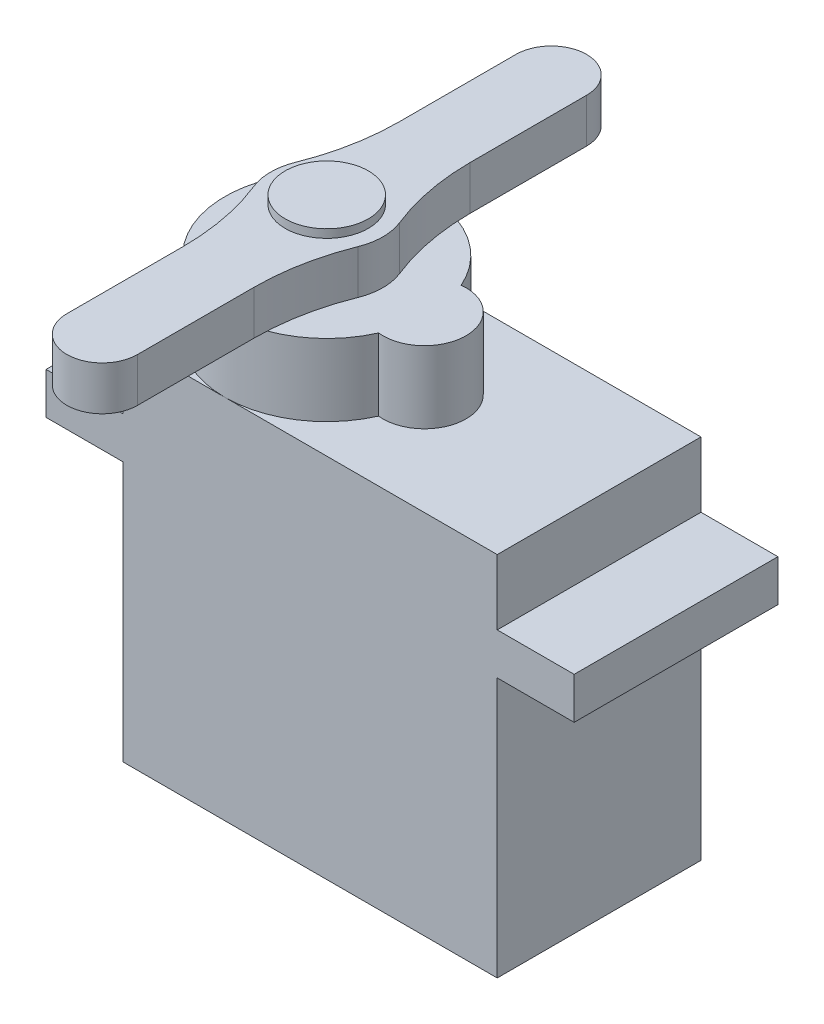
ISO-10303-21;
HEADER;
FILE_DESCRIPTION(('STEP AP214'),'2;1');
FILE_NAME('part.step','',(''),(''),'','','');
FILE_SCHEMA(('AUTOMOTIVE_DESIGN { 1 0 10303 214 1 1 1 1 }'));
ENDSEC;
DATA;
#1=APPLICATION_CONTEXT('core data for automotive mechanical design processes');
#2=APPLICATION_PROTOCOL_DEFINITION('international standard','automotive_design',2000,#1);
#3=PRODUCT_CONTEXT('',#1,'mechanical');
#4=PRODUCT('Part','Part','',(#3));
#5=PRODUCT_RELATED_PRODUCT_CATEGORY('part','',(#4));
#6=PRODUCT_DEFINITION_FORMATION('','',#4);
#7=PRODUCT_DEFINITION_CONTEXT('part definition',#1,'design');
#8=PRODUCT_DEFINITION('design','',#6,#7);
#9=PRODUCT_DEFINITION_SHAPE('','',#8);
#10=(LENGTH_UNIT() NAMED_UNIT(*) SI_UNIT(.MILLI.,.METRE.));
#11=(NAMED_UNIT(*) PLANE_ANGLE_UNIT() SI_UNIT($,.RADIAN.));
#12=(NAMED_UNIT(*) SI_UNIT($,.STERADIAN.) SOLID_ANGLE_UNIT());
#13=UNCERTAINTY_MEASURE_WITH_UNIT(LENGTH_MEASURE(1.E-05),#10,'distance_accuracy_value','');
#14=(GEOMETRIC_REPRESENTATION_CONTEXT(3) GLOBAL_UNCERTAINTY_ASSIGNED_CONTEXT((#13)) GLOBAL_UNIT_ASSIGNED_CONTEXT((#10,
#11,#12)) REPRESENTATION_CONTEXT('',''));
#15=CARTESIAN_POINT('',(0.,0.,0.));
#16=DIRECTION('',(0.,0.,1.));
#17=DIRECTION('',(1.,0.,0.));
#18=AXIS2_PLACEMENT_3D('',#15,#16,#17);
#19=CARTESIAN_POINT('',(-11.43,5.588,-1.905));
#20=DIRECTION('',(1.,0.,0.));
#21=DIRECTION('',(0.,0.,-1.));
#22=AXIS2_PLACEMENT_3D('',#19,#20,#21);
#23=PLANE('',#22);
#24=DIRECTION('',(0.,0.,1.));
#25=VECTOR('',#24,1.);
#26=CARTESIAN_POINT('',(-11.43,4.318,-1.905));
#27=LINE('',#26,#25);
#28=CARTESIAN_POINT('',(-11.43,4.318,-1.905));
#29=VERTEX_POINT('',#28);
#30=CARTESIAN_POINT('',(-11.43,4.318,1.905));
#31=VERTEX_POINT('',#30);
#32=EDGE_CURVE('E111',#29,#31,#27,.T.);
#33=ORIENTED_EDGE('',*,*,#32,.F.);
#34=DIRECTION('',(0.,-1.,0.));
#35=VECTOR('',#34,1.);
#36=CARTESIAN_POINT('',(-11.43,5.588,-1.905));
#37=LINE('',#36,#35);
#38=CARTESIAN_POINT('',(-11.43,5.588,-1.905));
#39=VERTEX_POINT('',#38);
#40=EDGE_CURVE('E12',#39,#29,#37,.T.);
#41=ORIENTED_EDGE('',*,*,#40,.F.);
#42=DIRECTION('',(0.,0.,1.));
#43=VECTOR('',#42,1.);
#44=CARTESIAN_POINT('',(-11.43,5.588,-1.905));
#45=LINE('',#44,#43);
#46=CARTESIAN_POINT('',(-11.43,5.588,1.905));
#47=VERTEX_POINT('',#46);
#48=EDGE_CURVE('E105',#39,#47,#45,.T.);
#49=ORIENTED_EDGE('',*,*,#48,.T.);
#50=DIRECTION('',(0.,-1.,0.));
#51=VECTOR('',#50,1.);
#52=CARTESIAN_POINT('',(-11.43,5.588,1.905));
#53=LINE('',#52,#51);
#54=EDGE_CURVE('E50',#47,#31,#53,.T.);
#55=ORIENTED_EDGE('',*,*,#54,.T.);
#56=EDGE_LOOP('',(#33,#41,#49,#55));
#57=FACE_BOUND('',#56,.T.);
#58=ADVANCED_FACE('F47',(#57),#23,.T.);
#59=CARTESIAN_POINT('',(-11.43,5.588,-1.905));
#60=DIRECTION('',(0.,0.,-1.));
#61=DIRECTION('',(-1.,0.,0.));
#62=AXIS2_PLACEMENT_3D('',#59,#60,#61);
#63=PLANE('',#62);
#64=DIRECTION('',(1.,0.,0.));
#65=VECTOR('',#64,1.);
#66=CARTESIAN_POINT('',(-11.43,4.318,-1.905));
#67=LINE('',#66,#65);
#68=CARTESIAN_POINT('',(-13.208,4.318,-1.905));
#69=VERTEX_POINT('',#68);
#70=EDGE_CURVE('E107',#69,#29,#67,.T.);
#71=ORIENTED_EDGE('',*,*,#70,.F.);
#72=DIRECTION('',(0.,-1.,0.));
#73=VECTOR('',#72,1.);
#74=CARTESIAN_POINT('',(-13.208,5.588,-1.905));
#75=LINE('',#74,#73);
#76=CARTESIAN_POINT('',(-13.208,5.588,-1.905));
#77=VERTEX_POINT('',#76);
#78=EDGE_CURVE('E56',#77,#69,#75,.T.);
#79=ORIENTED_EDGE('',*,*,#78,.F.);
#80=DIRECTION('',(1.,0.,0.));
#81=VECTOR('',#80,1.);
#82=CARTESIAN_POINT('',(-11.43,5.588,-1.905));
#83=LINE('',#82,#81);
#84=EDGE_CURVE('E102',#77,#39,#83,.T.);
#85=ORIENTED_EDGE('',*,*,#84,.T.);
#86=ORIENTED_EDGE('',*,*,#40,.T.);
#87=EDGE_LOOP('',(#71,#79,#85,#86));
#88=FACE_BOUND('',#87,.T.);
#89=ADVANCED_FACE('F121',(#88),#63,.T.);
#90=CARTESIAN_POINT('',(-13.208,5.588,-1.905));
#91=DIRECTION('',(-1.,0.,0.));
#92=DIRECTION('',(0.,0.,1.));
#93=AXIS2_PLACEMENT_3D('',#90,#91,#92);
#94=PLANE('',#93);
#95=DIRECTION('',(0.,0.,-1.));
#96=VECTOR('',#95,1.);
#97=CARTESIAN_POINT('',(-13.208,4.318,-1.905));
#98=LINE('',#97,#96);
#99=CARTESIAN_POINT('',(-13.208,4.318,1.905));
#100=VERTEX_POINT('',#99);
#101=EDGE_CURVE('E97',#100,#69,#98,.T.);
#102=ORIENTED_EDGE('',*,*,#101,.F.);
#103=DIRECTION('',(0.,-1.,0.));
#104=VECTOR('',#103,1.);
#105=CARTESIAN_POINT('',(-13.208,5.588,1.905));
#106=LINE('',#105,#104);
#107=CARTESIAN_POINT('',(-13.208,5.588,1.905));
#108=VERTEX_POINT('',#107);
#109=EDGE_CURVE('E92',#108,#100,#106,.T.);
#110=ORIENTED_EDGE('',*,*,#109,.F.);
#111=DIRECTION('',(0.,0.,-1.));
#112=VECTOR('',#111,1.);
#113=CARTESIAN_POINT('',(-13.208,5.588,-1.905));
#114=LINE('',#113,#112);
#115=EDGE_CURVE('E95',#108,#77,#114,.T.);
#116=ORIENTED_EDGE('',*,*,#115,.T.);
#117=ORIENTED_EDGE('',*,*,#78,.T.);
#118=EDGE_LOOP('',(#102,#110,#116,#117));
#119=FACE_BOUND('',#118,.T.);
#120=ADVANCED_FACE('F94',(#119),#94,.T.);
#121=CARTESIAN_POINT('',(-11.43,5.588,1.905));
#122=DIRECTION('',(0.,0.,1.));
#123=DIRECTION('',(1.,0.,0.));
#124=AXIS2_PLACEMENT_3D('',#121,#122,#123);
#125=PLANE('',#124);
#126=DIRECTION('',(-1.,0.,0.));
#127=VECTOR('',#126,1.);
#128=CARTESIAN_POINT('',(-11.43,4.318,1.905));
#129=LINE('',#128,#127);
#130=EDGE_CURVE('E114',#31,#100,#129,.T.);
#131=ORIENTED_EDGE('',*,*,#130,.F.);
#132=ORIENTED_EDGE('',*,*,#54,.F.);
#133=DIRECTION('',(-1.,0.,0.));
#134=VECTOR('',#133,1.);
#135=CARTESIAN_POINT('',(-11.43,5.588,1.905));
#136=LINE('',#135,#134);
#137=EDGE_CURVE('E101',#47,#108,#136,.T.);
#138=ORIENTED_EDGE('',*,*,#137,.T.);
#139=ORIENTED_EDGE('',*,*,#109,.T.);
#140=EDGE_LOOP('',(#131,#132,#138,#139));
#141=FACE_BOUND('',#140,.T.);
#142=ADVANCED_FACE('F104',(#141),#125,.T.);
#143=CARTESIAN_POINT('',(0.,5.588,0.));
#144=DIRECTION('',(0.,-1.,0.));
#145=DIRECTION('',(0.,0.,-1.));
#146=AXIS2_PLACEMENT_3D('',#143,#144,#145);
#147=PLANE('',#146);
#148=ORIENTED_EDGE('',*,*,#48,.F.);
#149=ORIENTED_EDGE('',*,*,#84,.F.);
#150=ORIENTED_EDGE('',*,*,#115,.F.);
#151=ORIENTED_EDGE('',*,*,#137,.F.);
#152=EDGE_LOOP('',(#148,#149,#150,#151));
#153=FACE_BOUND('',#152,.T.);
#154=ADVANCED_FACE('F100',(#153),#147,.F.);
#155=CARTESIAN_POINT('',(0.,4.318,0.));
#156=DIRECTION('',(0.,-1.,0.));
#157=DIRECTION('',(0.,0.,-1.));
#158=AXIS2_PLACEMENT_3D('',#155,#156,#157);
#159=PLANE('',#158);
#160=ORIENTED_EDGE('',*,*,#32,.T.);
#161=ORIENTED_EDGE('',*,*,#130,.T.);
#162=ORIENTED_EDGE('',*,*,#101,.T.);
#163=ORIENTED_EDGE('',*,*,#70,.T.);
#164=EDGE_LOOP('',(#160,#161,#162,#163));
#165=FACE_BOUND('',#164,.T.);
#166=ADVANCED_FACE('F120',(#165),#159,.T.);
#167=CLOSED_SHELL('',(#58,#89,#120,#142,#154,#166));
#168=MANIFOLD_SOLID_BREP('B2',#167);
#169=CARTESIAN_POINT('',(-21.7424,62.4822207368893,-6.604));
#170=DIRECTION('',(0.,-1.,0.));
#171=DIRECTION('',(0.,0.,-1.));
#172=AXIS2_PLACEMENT_3D('',#169,#170,#171);
#173=CYLINDRICAL_SURFACE('',#172,14.3764);
#174=CARTESIAN_POINT('',(-21.7424,29.492,-6.604));
#175=DIRECTION('',(0.,1.,0.));
#176=DIRECTION('',(0.,0.,1.));
#177=AXIS2_PLACEMENT_3D('',#174,#175,#176);
#178=CIRCLE('',#177,14.3764);
#179=CARTESIAN_POINT('',(-7.366,29.492,-6.604));
#180=VERTEX_POINT('',#179);
#181=CARTESIAN_POINT('',(-8.39142082738945,29.492,-1.27181169757489));
#182=VERTEX_POINT('',#181);
#183=EDGE_CURVE('E315',#180,#182,#178,.F.);
#184=ORIENTED_EDGE('',*,*,#183,.F.);
#185=DIRECTION('',(0.,-1.,0.));
#186=VECTOR('',#185,1.);
#187=CARTESIAN_POINT('',(-7.366,62.4822207368893,-6.604));
#188=LINE('',#187,#186);
#189=CARTESIAN_POINT('',(-7.366,26.8,-6.604));
#190=VERTEX_POINT('',#189);
#191=EDGE_CURVE('E184',#180,#190,#188,.T.);
#192=ORIENTED_EDGE('',*,*,#191,.T.);
#193=CARTESIAN_POINT('',(-21.7424,26.8,-6.604));
#194=DIRECTION('',(0.,-1.,0.));
#195=DIRECTION('',(0.,0.,-1.));
#196=AXIS2_PLACEMENT_3D('',#193,#194,#195);
#197=CIRCLE('',#196,14.3764);
#198=CARTESIAN_POINT('',(-8.39142082738945,26.8,-1.27181169757489));
#199=VERTEX_POINT('',#198);
#200=EDGE_CURVE('E323',#190,#199,#197,.T.);
#201=ORIENTED_EDGE('',*,*,#200,.T.);
#202=DIRECTION('',(0.,-1.,0.));
#203=VECTOR('',#202,1.);
#204=CARTESIAN_POINT('',(-8.39142082738945,62.4822207368893,-1.27181169757489));
#205=LINE('',#204,#203);
#206=EDGE_CURVE('E251',#182,#199,#205,.T.);
#207=ORIENTED_EDGE('',*,*,#206,.F.);
#208=EDGE_LOOP('',(#184,#192,#201,#207));
#209=FACE_BOUND('',#208,.T.);
#210=ADVANCED_FACE('F180',(#209),#173,.F.);
#211=CARTESIAN_POINT('',(-5.207,62.4822207368893,0.));
#212=DIRECTION('',(0.,-1.,0.));
#213=DIRECTION('',(0.,0.,-1.));
#214=AXIS2_PLACEMENT_3D('',#211,#212,#213);
#215=CYLINDRICAL_SURFACE('',#214,3.429);
#216=CARTESIAN_POINT('',(-5.207,29.492,0.));
#217=DIRECTION('',(0.,1.,0.));
#218=DIRECTION('',(0.,0.,1.));
#219=AXIS2_PLACEMENT_3D('',#216,#217,#218);
#220=CIRCLE('',#219,3.429);
#221=CARTESIAN_POINT('',(-8.39142082738944,29.492,1.27181169757489));
#222=VERTEX_POINT('',#221);
#223=EDGE_CURVE('E258',#182,#222,#220,.T.);
#224=ORIENTED_EDGE('',*,*,#223,.F.);
#225=ORIENTED_EDGE('',*,*,#206,.T.);
#226=CARTESIAN_POINT('',(-5.207,26.8,0.));
#227=DIRECTION('',(0.,1.,0.));
#228=DIRECTION('',(0.,0.,1.));
#229=AXIS2_PLACEMENT_3D('',#226,#227,#228);
#230=CIRCLE('',#229,3.429);
#231=CARTESIAN_POINT('',(-8.39142082738944,26.8,1.27181169757489));
#232=VERTEX_POINT('',#231);
#233=EDGE_CURVE('E322',#199,#232,#230,.T.);
#234=ORIENTED_EDGE('',*,*,#233,.T.);
#235=DIRECTION('',(0.,-1.,0.));
#236=VECTOR('',#235,1.);
#237=CARTESIAN_POINT('',(-8.39142082738944,62.4822207368893,1.27181169757489));
#238=LINE('',#237,#236);
#239=EDGE_CURVE('E324',#222,#232,#238,.T.);
#240=ORIENTED_EDGE('',*,*,#239,.F.);
#241=EDGE_LOOP('',(#224,#225,#234,#240));
#242=FACE_BOUND('',#241,.T.);
#243=ADVANCED_FACE('F373',(#242),#215,.T.);
#244=CARTESIAN_POINT('',(-21.7424,62.4822207368893,6.604));
#245=DIRECTION('',(0.,-1.,0.));
#246=DIRECTION('',(0.,0.,-1.));
#247=AXIS2_PLACEMENT_3D('',#244,#245,#246);
#248=CYLINDRICAL_SURFACE('',#247,14.3764);
#249=CARTESIAN_POINT('',(-21.7424,29.492,6.604));
#250=DIRECTION('',(0.,1.,0.));
#251=DIRECTION('',(0.,0.,1.));
#252=AXIS2_PLACEMENT_3D('',#249,#250,#251);
#253=CIRCLE('',#252,14.3764);
#254=CARTESIAN_POINT('',(-7.366,29.492,6.604));
#255=VERTEX_POINT('',#254);
#256=EDGE_CURVE('E311',#222,#255,#253,.F.);
#257=ORIENTED_EDGE('',*,*,#256,.F.);
#258=ORIENTED_EDGE('',*,*,#239,.T.);
#259=CARTESIAN_POINT('',(-21.7424,26.8,6.604));
#260=DIRECTION('',(0.,-1.,0.));
#261=DIRECTION('',(0.,0.,-1.));
#262=AXIS2_PLACEMENT_3D('',#259,#260,#261);
#263=CIRCLE('',#262,14.3764);
#264=CARTESIAN_POINT('',(-7.366,26.8,6.604));
#265=VERTEX_POINT('',#264);
#266=EDGE_CURVE('E326',#232,#265,#263,.T.);
#267=ORIENTED_EDGE('',*,*,#266,.T.);
#268=DIRECTION('',(0.,-1.,0.));
#269=VECTOR('',#268,1.);
#270=CARTESIAN_POINT('',(-7.366,62.4822207368893,6.604));
#271=LINE('',#270,#269);
#272=EDGE_CURVE('E327',#255,#265,#271,.T.);
#273=ORIENTED_EDGE('',*,*,#272,.F.);
#274=EDGE_LOOP('',(#257,#258,#267,#273));
#275=FACE_BOUND('',#274,.T.);
#276=ADVANCED_FACE('F376',(#275),#248,.F.);
#277=CARTESIAN_POINT('',(-7.366,62.4822207368893,6.604));
#278=DIRECTION('',(1.,0.,0.));
#279=DIRECTION('',(0.,0.,-1.));
#280=AXIS2_PLACEMENT_3D('',#277,#278,#279);
#281=PLANE('',#280);
#282=DIRECTION('',(0.,0.,1.));
#283=VECTOR('',#282,1.);
#284=CARTESIAN_POINT('',(-7.366,29.492,6.604));
#285=LINE('',#284,#283);
#286=CARTESIAN_POINT('',(-7.366,29.492,13.716));
#287=VERTEX_POINT('',#286);
#288=EDGE_CURVE('E308',#255,#287,#285,.T.);
#289=ORIENTED_EDGE('',*,*,#288,.F.);
#290=ORIENTED_EDGE('',*,*,#272,.T.);
#291=DIRECTION('',(0.,0.,1.));
#292=VECTOR('',#291,1.);
#293=CARTESIAN_POINT('',(-7.366,26.8,6.604));
#294=LINE('',#293,#292);
#295=CARTESIAN_POINT('',(-7.366,26.8,13.716));
#296=VERTEX_POINT('',#295);
#297=EDGE_CURVE('E329',#265,#296,#294,.T.);
#298=ORIENTED_EDGE('',*,*,#297,.T.);
#299=DIRECTION('',(0.,-1.,0.));
#300=VECTOR('',#299,1.);
#301=CARTESIAN_POINT('',(-7.366,62.4822207368893,13.716));
#302=LINE('',#301,#300);
#303=EDGE_CURVE('E330',#287,#296,#302,.T.);
#304=ORIENTED_EDGE('',*,*,#303,.F.);
#305=EDGE_LOOP('',(#289,#290,#298,#304));
#306=FACE_BOUND('',#305,.T.);
#307=ADVANCED_FACE('F378',(#306),#281,.F.);
#308=CARTESIAN_POINT('',(-5.207,62.4822207368893,13.716));
#309=DIRECTION('',(0.,-1.,0.));
#310=DIRECTION('',(0.,0.,-1.));
#311=AXIS2_PLACEMENT_3D('',#308,#309,#310);
#312=CYLINDRICAL_SURFACE('',#311,2.159);
#313=CARTESIAN_POINT('',(-5.207,29.492,13.716));
#314=DIRECTION('',(0.,1.,0.));
#315=DIRECTION('',(0.,0.,1.));
#316=AXIS2_PLACEMENT_3D('',#313,#314,#315);
#317=CIRCLE('',#316,2.159);
#318=CARTESIAN_POINT('',(-3.048,29.492,13.716));
#319=VERTEX_POINT('',#318);
#320=EDGE_CURVE('E305',#287,#319,#317,.T.);
#321=ORIENTED_EDGE('',*,*,#320,.F.);
#322=ORIENTED_EDGE('',*,*,#303,.T.);
#323=CARTESIAN_POINT('',(-5.207,26.8,13.716));
#324=DIRECTION('',(0.,1.,0.));
#325=DIRECTION('',(0.,0.,1.));
#326=AXIS2_PLACEMENT_3D('',#323,#324,#325);
#327=CIRCLE('',#326,2.159);
#328=CARTESIAN_POINT('',(-3.048,26.8,13.716));
#329=VERTEX_POINT('',#328);
#330=EDGE_CURVE('E332',#296,#329,#327,.T.);
#331=ORIENTED_EDGE('',*,*,#330,.T.);
#332=DIRECTION('',(0.,-1.,0.));
#333=VECTOR('',#332,1.);
#334=CARTESIAN_POINT('',(-3.048,62.4822207368893,13.716));
#335=LINE('',#334,#333);
#336=EDGE_CURVE('E333',#319,#329,#335,.T.);
#337=ORIENTED_EDGE('',*,*,#336,.F.);
#338=EDGE_LOOP('',(#321,#322,#331,#337));
#339=FACE_BOUND('',#338,.T.);
#340=ADVANCED_FACE('F382',(#339),#312,.T.);
#341=CARTESIAN_POINT('',(-3.048,62.4822207368893,13.716));
#342=DIRECTION('',(-1.,0.,0.));
#343=DIRECTION('',(0.,0.,1.));
#344=AXIS2_PLACEMENT_3D('',#341,#342,#343);
#345=PLANE('',#344);
#346=DIRECTION('',(0.,0.,-1.));
#347=VECTOR('',#346,1.);
#348=CARTESIAN_POINT('',(-3.048,29.492,13.716));
#349=LINE('',#348,#347);
#350=CARTESIAN_POINT('',(-3.048,29.492,6.604));
#351=VERTEX_POINT('',#350);
#352=EDGE_CURVE('E302',#319,#351,#349,.T.);
#353=ORIENTED_EDGE('',*,*,#352,.F.);
#354=ORIENTED_EDGE('',*,*,#336,.T.);
#355=DIRECTION('',(0.,0.,-1.));
#356=VECTOR('',#355,1.);
#357=CARTESIAN_POINT('',(-3.048,26.8,13.716));
#358=LINE('',#357,#356);
#359=CARTESIAN_POINT('',(-3.048,26.8,6.604));
#360=VERTEX_POINT('',#359);
#361=EDGE_CURVE('E335',#329,#360,#358,.T.);
#362=ORIENTED_EDGE('',*,*,#361,.T.);
#363=DIRECTION('',(0.,-1.,0.));
#364=VECTOR('',#363,1.);
#365=CARTESIAN_POINT('',(-3.048,62.4822207368893,6.604));
#366=LINE('',#365,#364);
#367=EDGE_CURVE('E336',#351,#360,#366,.T.);
#368=ORIENTED_EDGE('',*,*,#367,.F.);
#369=EDGE_LOOP('',(#353,#354,#362,#368));
#370=FACE_BOUND('',#369,.T.);
#371=ADVANCED_FACE('F387',(#370),#345,.F.);
#372=CARTESIAN_POINT('',(11.3284,62.4822207368893,6.604));
#373=DIRECTION('',(0.,-1.,0.));
#374=DIRECTION('',(0.,0.,-1.));
#375=AXIS2_PLACEMENT_3D('',#372,#373,#374);
#376=CYLINDRICAL_SURFACE('',#375,14.3764);
#377=CARTESIAN_POINT('',(11.3284,29.492,6.604));
#378=DIRECTION('',(0.,1.,0.));
#379=DIRECTION('',(0.,0.,1.));
#380=AXIS2_PLACEMENT_3D('',#377,#378,#379);
#381=CIRCLE('',#380,14.3764);
#382=CARTESIAN_POINT('',(-2.02257917261055,29.492,1.27181169757489));
#383=VERTEX_POINT('',#382);
#384=EDGE_CURVE('E299',#351,#383,#381,.F.);
#385=ORIENTED_EDGE('',*,*,#384,.F.);
#386=ORIENTED_EDGE('',*,*,#367,.T.);
#387=CARTESIAN_POINT('',(11.3284,26.8,6.604));
#388=DIRECTION('',(0.,-1.,0.));
#389=DIRECTION('',(0.,0.,1.));
#390=AXIS2_PLACEMENT_3D('',#387,#388,#389);
#391=CIRCLE('',#390,14.3764);
#392=CARTESIAN_POINT('',(-2.02257917261055,26.8,1.27181169757489));
#393=VERTEX_POINT('',#392);
#394=EDGE_CURVE('E338',#360,#393,#391,.T.);
#395=ORIENTED_EDGE('',*,*,#394,.T.);
#396=DIRECTION('',(0.,-1.,0.));
#397=VECTOR('',#396,1.);
#398=CARTESIAN_POINT('',(-2.02257917261055,62.4822207368893,1.27181169757489));
#399=LINE('',#398,#397);
#400=EDGE_CURVE('E339',#383,#393,#399,.T.);
#401=ORIENTED_EDGE('',*,*,#400,.F.);
#402=EDGE_LOOP('',(#385,#386,#395,#401));
#403=FACE_BOUND('',#402,.T.);
#404=ADVANCED_FACE('F390',(#403),#376,.F.);
#405=CARTESIAN_POINT('',(-5.207,62.4822207368893,0.));
#406=DIRECTION('',(0.,-1.,0.));
#407=DIRECTION('',(0.,0.,-1.));
#408=AXIS2_PLACEMENT_3D('',#405,#406,#407);
#409=CYLINDRICAL_SURFACE('',#408,3.429);
#410=CARTESIAN_POINT('',(-5.207,29.492,0.));
#411=DIRECTION('',(0.,1.,0.));
#412=DIRECTION('',(0.,0.,1.));
#413=AXIS2_PLACEMENT_3D('',#410,#411,#412);
#414=CIRCLE('',#413,3.429);
#415=CARTESIAN_POINT('',(-2.02257917261056,29.492,-1.2718116975749));
#416=VERTEX_POINT('',#415);
#417=EDGE_CURVE('E294',#383,#416,#414,.T.);
#418=ORIENTED_EDGE('',*,*,#417,.F.);
#419=ORIENTED_EDGE('',*,*,#400,.T.);
#420=CARTESIAN_POINT('',(-5.207,26.8,0.));
#421=DIRECTION('',(0.,1.,0.));
#422=DIRECTION('',(0.,0.,1.));
#423=AXIS2_PLACEMENT_3D('',#420,#421,#422);
#424=CIRCLE('',#423,3.429);
#425=CARTESIAN_POINT('',(-2.02257917261056,26.8,-1.2718116975749));
#426=VERTEX_POINT('',#425);
#427=EDGE_CURVE('E341',#393,#426,#424,.T.);
#428=ORIENTED_EDGE('',*,*,#427,.T.);
#429=DIRECTION('',(0.,-1.,0.));
#430=VECTOR('',#429,1.);
#431=CARTESIAN_POINT('',(-2.02257917261056,62.4822207368893,-1.2718116975749));
#432=LINE('',#431,#430);
#433=EDGE_CURVE('E342',#416,#426,#432,.T.);
#434=ORIENTED_EDGE('',*,*,#433,.F.);
#435=EDGE_LOOP('',(#418,#419,#428,#434));
#436=FACE_BOUND('',#435,.T.);
#437=ADVANCED_FACE('F394',(#436),#409,.T.);
#438=CARTESIAN_POINT('',(11.3284,62.4822207368893,-6.604));
#439=DIRECTION('',(0.,-1.,0.));
#440=DIRECTION('',(0.,0.,-1.));
#441=AXIS2_PLACEMENT_3D('',#438,#439,#440);
#442=CYLINDRICAL_SURFACE('',#441,14.3764);
#443=CARTESIAN_POINT('',(11.3284,29.492,-6.604));
#444=DIRECTION('',(0.,1.,0.));
#445=DIRECTION('',(0.,0.,1.));
#446=AXIS2_PLACEMENT_3D('',#443,#444,#445);
#447=CIRCLE('',#446,14.3764);
#448=CARTESIAN_POINT('',(-3.048,29.492,-6.604));
#449=VERTEX_POINT('',#448);
#450=EDGE_CURVE('E292',#416,#449,#447,.F.);
#451=ORIENTED_EDGE('',*,*,#450,.F.);
#452=ORIENTED_EDGE('',*,*,#433,.T.);
#453=CARTESIAN_POINT('',(11.3284,26.8,-6.604));
#454=DIRECTION('',(0.,-1.,0.));
#455=DIRECTION('',(0.,0.,1.));
#456=AXIS2_PLACEMENT_3D('',#453,#454,#455);
#457=CIRCLE('',#456,14.3764);
#458=CARTESIAN_POINT('',(-3.048,26.8,-6.604));
#459=VERTEX_POINT('',#458);
#460=EDGE_CURVE('E344',#426,#459,#457,.T.);
#461=ORIENTED_EDGE('',*,*,#460,.T.);
#462=DIRECTION('',(0.,-1.,0.));
#463=VECTOR('',#462,1.);
#464=CARTESIAN_POINT('',(-3.048,62.4822207368893,-6.604));
#465=LINE('',#464,#463);
#466=EDGE_CURVE('E345',#449,#459,#465,.T.);
#467=ORIENTED_EDGE('',*,*,#466,.F.);
#468=EDGE_LOOP('',(#451,#452,#461,#467));
#469=FACE_BOUND('',#468,.T.);
#470=ADVANCED_FACE('F398',(#469),#442,.F.);
#471=CARTESIAN_POINT('',(-3.048,62.4822207368893,-13.716));
#472=DIRECTION('',(-1.,0.,0.));
#473=DIRECTION('',(0.,0.,1.));
#474=AXIS2_PLACEMENT_3D('',#471,#472,#473);
#475=PLANE('',#474);
#476=DIRECTION('',(0.,0.,-1.));
#477=VECTOR('',#476,1.);
#478=CARTESIAN_POINT('',(-3.048,29.492,-13.716));
#479=LINE('',#478,#477);
#480=CARTESIAN_POINT('',(-3.048,29.492,-13.716));
#481=VERTEX_POINT('',#480);
#482=EDGE_CURVE('E189',#449,#481,#479,.T.);
#483=ORIENTED_EDGE('',*,*,#482,.F.);
#484=ORIENTED_EDGE('',*,*,#466,.T.);
#485=DIRECTION('',(0.,0.,-1.));
#486=VECTOR('',#485,1.);
#487=CARTESIAN_POINT('',(-3.048,26.8,-13.716));
#488=LINE('',#487,#486);
#489=CARTESIAN_POINT('',(-3.048,26.8,-13.716));
#490=VERTEX_POINT('',#489);
#491=EDGE_CURVE('E286',#459,#490,#488,.T.);
#492=ORIENTED_EDGE('',*,*,#491,.T.);
#493=DIRECTION('',(0.,-1.,0.));
#494=VECTOR('',#493,1.);
#495=CARTESIAN_POINT('',(-3.048,62.4822207368893,-13.716));
#496=LINE('',#495,#494);
#497=EDGE_CURVE('E277',#481,#490,#496,.T.);
#498=ORIENTED_EDGE('',*,*,#497,.F.);
#499=EDGE_LOOP('',(#483,#484,#492,#498));
#500=FACE_BOUND('',#499,.T.);
#501=ADVANCED_FACE('F283',(#500),#475,.F.);
#502=CARTESIAN_POINT('',(-5.207,62.4822207368893,-13.716));
#503=DIRECTION('',(0.,-1.,0.));
#504=DIRECTION('',(0.,0.,-1.));
#505=AXIS2_PLACEMENT_3D('',#502,#503,#504);
#506=CYLINDRICAL_SURFACE('',#505,2.159);
#507=CARTESIAN_POINT('',(-5.207,29.492,-13.716));
#508=DIRECTION('',(0.,1.,0.));
#509=DIRECTION('',(0.,0.,1.));
#510=AXIS2_PLACEMENT_3D('',#507,#508,#509);
#511=CIRCLE('',#510,2.159);
#512=CARTESIAN_POINT('',(-7.366,29.492,-13.716));
#513=VERTEX_POINT('',#512);
#514=EDGE_CURVE('E45',#481,#513,#511,.T.);
#515=ORIENTED_EDGE('',*,*,#514,.F.);
#516=ORIENTED_EDGE('',*,*,#497,.T.);
#517=CARTESIAN_POINT('',(-5.207,26.8,-13.716));
#518=DIRECTION('',(0.,1.,0.));
#519=DIRECTION('',(0.,0.,-1.));
#520=AXIS2_PLACEMENT_3D('',#517,#518,#519);
#521=CIRCLE('',#520,2.159);
#522=CARTESIAN_POINT('',(-7.366,26.8,-13.716));
#523=VERTEX_POINT('',#522);
#524=EDGE_CURVE('E288',#490,#523,#521,.T.);
#525=ORIENTED_EDGE('',*,*,#524,.T.);
#526=DIRECTION('',(0.,-1.,0.));
#527=VECTOR('',#526,1.);
#528=CARTESIAN_POINT('',(-7.366,62.4822207368893,-13.716));
#529=LINE('',#528,#527);
#530=EDGE_CURVE('E202',#513,#523,#529,.T.);
#531=ORIENTED_EDGE('',*,*,#530,.F.);
#532=EDGE_LOOP('',(#515,#516,#525,#531));
#533=FACE_BOUND('',#532,.T.);
#534=ADVANCED_FACE('F276',(#533),#506,.T.);
#535=CARTESIAN_POINT('',(-7.366,62.4822207368893,-6.604));
#536=DIRECTION('',(1.,0.,0.));
#537=DIRECTION('',(0.,0.,-1.));
#538=AXIS2_PLACEMENT_3D('',#535,#536,#537);
#539=PLANE('',#538);
#540=DIRECTION('',(0.,0.,1.));
#541=VECTOR('',#540,1.);
#542=CARTESIAN_POINT('',(-7.366,29.492,-6.604));
#543=LINE('',#542,#541);
#544=EDGE_CURVE('E318',#513,#180,#543,.T.);
#545=ORIENTED_EDGE('',*,*,#544,.F.);
#546=ORIENTED_EDGE('',*,*,#530,.T.);
#547=DIRECTION('',(0.,0.,1.));
#548=VECTOR('',#547,1.);
#549=CARTESIAN_POINT('',(-7.366,26.8,-6.604));
#550=LINE('',#549,#548);
#551=EDGE_CURVE('E320',#523,#190,#550,.T.);
#552=ORIENTED_EDGE('',*,*,#551,.T.);
#553=ORIENTED_EDGE('',*,*,#191,.F.);
#554=EDGE_LOOP('',(#545,#546,#552,#553));
#555=FACE_BOUND('',#554,.T.);
#556=ADVANCED_FACE('F368',(#555),#539,.F.);
#557=CARTESIAN_POINT('',(-21.7424,26.8,-6.604));
#558=DIRECTION('',(0.,-1.,0.));
#559=DIRECTION('',(0.,0.,-1.));
#560=AXIS2_PLACEMENT_3D('',#557,#558,#559);
#561=PLANE('',#560);
#562=ORIENTED_EDGE('',*,*,#200,.F.);
#563=ORIENTED_EDGE('',*,*,#551,.F.);
#564=ORIENTED_EDGE('',*,*,#524,.F.);
#565=ORIENTED_EDGE('',*,*,#491,.F.);
#566=ORIENTED_EDGE('',*,*,#460,.F.);
#567=ORIENTED_EDGE('',*,*,#427,.F.);
#568=ORIENTED_EDGE('',*,*,#394,.F.);
#569=ORIENTED_EDGE('',*,*,#361,.F.);
#570=ORIENTED_EDGE('',*,*,#330,.F.);
#571=ORIENTED_EDGE('',*,*,#297,.F.);
#572=ORIENTED_EDGE('',*,*,#266,.F.);
#573=ORIENTED_EDGE('',*,*,#233,.F.);
#574=EDGE_LOOP('',(#562,#563,#564,#565,#566,#567,#568,#569,#570,#571,#572,#573));
#575=FACE_BOUND('',#574,.T.);
#576=ADVANCED_FACE('F370',(#575),#561,.T.);
#577=CARTESIAN_POINT('',(0.,29.492,0.));
#578=DIRECTION('',(0.,1.,0.));
#579=DIRECTION('',(0.,0.,1.));
#580=AXIS2_PLACEMENT_3D('',#577,#578,#579);
#581=PLANE('',#580);
#582=ORIENTED_EDGE('',*,*,#544,.T.);
#583=ORIENTED_EDGE('',*,*,#183,.T.);
#584=ORIENTED_EDGE('',*,*,#223,.T.);
#585=ORIENTED_EDGE('',*,*,#256,.T.);
#586=ORIENTED_EDGE('',*,*,#288,.T.);
#587=ORIENTED_EDGE('',*,*,#320,.T.);
#588=ORIENTED_EDGE('',*,*,#352,.T.);
#589=ORIENTED_EDGE('',*,*,#384,.T.);
#590=ORIENTED_EDGE('',*,*,#417,.T.);
#591=ORIENTED_EDGE('',*,*,#450,.T.);
#592=ORIENTED_EDGE('',*,*,#482,.T.);
#593=ORIENTED_EDGE('',*,*,#514,.T.);
#594=EDGE_LOOP('',(#582,#583,#584,#585,#586,#587,#588,#589,#590,#591,#592,#593));
#595=FACE_BOUND('',#594,.T.);
#596=ADVANCED_FACE('F182',(#595),#581,.T.);
#597=CLOSED_SHELL('',(#210,#243,#276,#307,#340,#371,#404,#437,#470,#501,#534,#556,#576,#596));
#598=MANIFOLD_SOLID_BREP('B6',#597);
#599=CARTESIAN_POINT('',(0.,22.4,0.));
#600=DIRECTION('',(0.,1.,0.));
#601=DIRECTION('',(0.,0.,1.));
#602=AXIS2_PLACEMENT_3D('',#599,#600,#601);
#603=PLANE('',#602);
#604=CARTESIAN_POINT('',(-5.207,22.4,0.));
#605=DIRECTION('',(0.,1.,0.));
#606=DIRECTION('',(0.,0.,1.));
#607=AXIS2_PLACEMENT_3D('',#604,#605,#606);
#608=CIRCLE('',#607,6.223);
#609=CARTESIAN_POINT('',(0.480978723404256,22.4,-2.5244062751666));
#610=VERTEX_POINT('',#609);
#611=CARTESIAN_POINT('',(-5.207,22.4,-6.223));
#612=VERTEX_POINT('',#611);
#613=EDGE_CURVE('E523',#610,#612,#608,.T.);
#614=ORIENTED_EDGE('',*,*,#613,.F.);
#615=CARTESIAN_POINT('',(0.761999999999999,22.4,0.));
#616=DIRECTION('',(0.,1.,0.));
#617=DIRECTION('',(0.,0.,1.));
#618=AXIS2_PLACEMENT_3D('',#615,#616,#617);
#619=CIRCLE('',#618,2.54);
#620=CARTESIAN_POINT('',(0.480978723404255,22.4,2.5244062751666));
#621=VERTEX_POINT('',#620);
#622=EDGE_CURVE('E530',#621,#610,#619,.T.);
#623=ORIENTED_EDGE('',*,*,#622,.F.);
#624=CARTESIAN_POINT('',(-5.207,22.4,6.223));
#625=VERTEX_POINT('',#624);
#626=EDGE_CURVE('E632',#625,#621,#608,.T.);
#627=ORIENTED_EDGE('',*,*,#626,.F.);
#628=DIRECTION('',(1.,0.,0.));
#629=VECTOR('',#628,1.);
#630=CARTESIAN_POINT('',(-11.43,22.4,6.223));
#631=LINE('',#630,#629);
#632=CARTESIAN_POINT('',(11.43,22.4,6.223));
#633=VERTEX_POINT('',#632);
#634=EDGE_CURVE('E699',#625,#633,#631,.T.);
#635=ORIENTED_EDGE('',*,*,#634,.T.);
#636=DIRECTION('',(0.,0.,-1.));
#637=VECTOR('',#636,1.);
#638=CARTESIAN_POINT('',(11.43,22.4,-6.223));
#639=LINE('',#638,#637);
#640=CARTESIAN_POINT('',(11.43,22.4,-6.223));
#641=VERTEX_POINT('',#640);
#642=EDGE_CURVE('E704',#633,#641,#639,.T.);
#643=ORIENTED_EDGE('',*,*,#642,.T.);
#644=DIRECTION('',(-1.,0.,0.));
#645=VECTOR('',#644,1.);
#646=CARTESIAN_POINT('',(-11.43,22.4,-6.223));
#647=LINE('',#646,#645);
#648=EDGE_CURVE('E707',#641,#612,#647,.T.);
#649=ORIENTED_EDGE('',*,*,#648,.T.);
#650=EDGE_LOOP('',(#614,#623,#627,#635,#643,#649));
#651=FACE_BOUND('',#650,.T.);
#652=ADVANCED_FACE('F512',(#651),#603,.T.);
#653=CARTESIAN_POINT('',(-11.43,22.4,0.));
#654=VERTEX_POINT('',#653);
#655=EDGE_CURVE('E178',#612,#654,#608,.T.);
#656=ORIENTED_EDGE('',*,*,#655,.F.);
#657=CARTESIAN_POINT('',(-11.43,22.4,-6.223));
#658=VERTEX_POINT('',#657);
#659=EDGE_CURVE('E706',#612,#658,#647,.T.);
#660=ORIENTED_EDGE('',*,*,#659,.T.);
#661=DIRECTION('',(0.,0.,1.));
#662=VECTOR('',#661,1.);
#663=CARTESIAN_POINT('',(-11.43,22.4,-6.223));
#664=LINE('',#663,#662);
#665=EDGE_CURVE('E697',#658,#654,#664,.T.);
#666=ORIENTED_EDGE('',*,*,#665,.T.);
#667=EDGE_LOOP('',(#656,#660,#666));
#668=FACE_BOUND('',#667,.T.);
#669=ADVANCED_FACE('F794',(#668),#603,.T.);
#670=CARTESIAN_POINT('',(11.43,22.4,-6.223));
#671=DIRECTION('',(-1.,0.,0.));
#672=DIRECTION('',(0.,0.,1.));
#673=AXIS2_PLACEMENT_3D('',#670,#671,#672);
#674=PLANE('',#673);
#675=DIRECTION('',(0.,0.,1.));
#676=VECTOR('',#675,1.);
#677=CARTESIAN_POINT('',(11.43,18.415,-11.5645541745825));
#678=LINE('',#677,#676);
#679=CARTESIAN_POINT('',(11.43,18.415,-6.223));
#680=VERTEX_POINT('',#679);
#681=CARTESIAN_POINT('',(11.43,18.415,6.223));
#682=VERTEX_POINT('',#681);
#683=EDGE_CURVE('E653',#680,#682,#678,.T.);
#684=ORIENTED_EDGE('',*,*,#683,.F.);
#685=DIRECTION('',(0.,-1.,0.));
#686=VECTOR('',#685,1.);
#687=CARTESIAN_POINT('',(11.43,22.4,-6.223));
#688=LINE('',#687,#686);
#689=EDGE_CURVE('E725',#641,#680,#688,.T.);
#690=ORIENTED_EDGE('',*,*,#689,.F.);
#691=ORIENTED_EDGE('',*,*,#642,.F.);
#692=DIRECTION('',(0.,-1.,0.));
#693=VECTOR('',#692,1.);
#694=CARTESIAN_POINT('',(11.43,22.4,6.223));
#695=LINE('',#694,#693);
#696=EDGE_CURVE('E728',#633,#682,#695,.T.);
#697=ORIENTED_EDGE('',*,*,#696,.T.);
#698=EDGE_LOOP('',(#684,#690,#691,#697));
#699=FACE_BOUND('',#698,.T.);
#700=ADVANCED_FACE('F763',(#699),#674,.F.);
#701=CARTESIAN_POINT('',(-11.43,22.4,-6.223));
#702=DIRECTION('',(1.,0.,0.));
#703=DIRECTION('',(0.,0.,-1.));
#704=AXIS2_PLACEMENT_3D('',#701,#702,#703);
#705=PLANE('',#704);
#706=DIRECTION('',(0.,0.,1.));
#707=VECTOR('',#706,1.);
#708=CARTESIAN_POINT('',(-11.43,15.875,-11.5645541745825));
#709=LINE('',#708,#707);
#710=CARTESIAN_POINT('',(-11.43,15.875,-6.223));
#711=VERTEX_POINT('',#710);
#712=CARTESIAN_POINT('',(-11.43,15.875,6.223));
#713=VERTEX_POINT('',#712);
#714=EDGE_CURVE('E691',#711,#713,#709,.T.);
#715=ORIENTED_EDGE('',*,*,#714,.F.);
#716=DIRECTION('',(0.,-1.,0.));
#717=VECTOR('',#716,1.);
#718=CARTESIAN_POINT('',(-11.43,22.4,-6.223));
#719=LINE('',#718,#717);
#720=CARTESIAN_POINT('',(-11.43,0.,-6.223));
#721=VERTEX_POINT('',#720);
#722=EDGE_CURVE('E710',#711,#721,#719,.T.);
#723=ORIENTED_EDGE('',*,*,#722,.T.);
#724=DIRECTION('',(0.,0.,1.));
#725=VECTOR('',#724,1.);
#726=CARTESIAN_POINT('',(-11.43,0.,-6.223));
#727=LINE('',#726,#725);
#728=CARTESIAN_POINT('',(-11.43,0.,6.223));
#729=VERTEX_POINT('',#728);
#730=EDGE_CURVE('E696',#721,#729,#727,.T.);
#731=ORIENTED_EDGE('',*,*,#730,.T.);
#732=DIRECTION('',(0.,-1.,0.));
#733=VECTOR('',#732,1.);
#734=CARTESIAN_POINT('',(-11.43,22.4,6.223));
#735=LINE('',#734,#733);
#736=EDGE_CURVE('E729',#713,#729,#735,.T.);
#737=ORIENTED_EDGE('',*,*,#736,.F.);
#738=EDGE_LOOP('',(#715,#723,#731,#737));
#739=FACE_BOUND('',#738,.T.);
#740=ADVANCED_FACE('F788',(#739),#705,.F.);
#741=CARTESIAN_POINT('',(-11.43,18.415,-6.223));
#742=VERTEX_POINT('',#741);
#743=EDGE_CURVE('E722',#658,#742,#719,.T.);
#744=ORIENTED_EDGE('',*,*,#743,.T.);
#745=DIRECTION('',(0.,0.,1.));
#746=VECTOR('',#745,1.);
#747=CARTESIAN_POINT('',(-11.43,18.415,-11.5645541745825));
#748=LINE('',#747,#746);
#749=CARTESIAN_POINT('',(-11.43,18.415,6.223));
#750=VERTEX_POINT('',#749);
#751=EDGE_CURVE('E689',#742,#750,#748,.T.);
#752=ORIENTED_EDGE('',*,*,#751,.T.);
#753=CARTESIAN_POINT('',(-11.43,22.4,6.223));
#754=VERTEX_POINT('',#753);
#755=EDGE_CURVE('E516',#754,#750,#735,.T.);
#756=ORIENTED_EDGE('',*,*,#755,.F.);
#757=EDGE_CURVE('E700',#654,#754,#664,.T.);
#758=ORIENTED_EDGE('',*,*,#757,.F.);
#759=ORIENTED_EDGE('',*,*,#665,.F.);
#760=EDGE_LOOP('',(#744,#752,#756,#758,#759));
#761=FACE_BOUND('',#760,.T.);
#762=ADVANCED_FACE('F514',(#761),#705,.F.);
#763=CARTESIAN_POINT('',(-11.43,22.4,6.223));
#764=DIRECTION('',(0.,0.,-1.));
#765=DIRECTION('',(-1.,0.,0.));
#766=AXIS2_PLACEMENT_3D('',#763,#764,#765);
#767=PLANE('',#766);
#768=DIRECTION('',(1.,0.,0.));
#769=VECTOR('',#768,1.);
#770=CARTESIAN_POINT('',(-11.43,0.,6.223));
#771=LINE('',#770,#769);
#772=CARTESIAN_POINT('',(11.43,0.,6.223));
#773=VERTEX_POINT('',#772);
#774=EDGE_CURVE('E713',#729,#773,#771,.T.);
#775=ORIENTED_EDGE('',*,*,#774,.T.);
#776=CARTESIAN_POINT('',(11.43,15.875,6.223));
#777=VERTEX_POINT('',#776);
#778=EDGE_CURVE('E727',#777,#773,#695,.T.);
#779=ORIENTED_EDGE('',*,*,#778,.F.);
#780=DIRECTION('',(1.,0.,0.));
#781=VECTOR('',#780,1.);
#782=CARTESIAN_POINT('',(11.43,15.875,6.223));
#783=LINE('',#782,#781);
#784=CARTESIAN_POINT('',(16.129,15.875,6.223));
#785=VERTEX_POINT('',#784);
#786=EDGE_CURVE('E641',#777,#785,#783,.T.);
#787=ORIENTED_EDGE('',*,*,#786,.T.);
#788=DIRECTION('',(0.,1.,0.));
#789=VECTOR('',#788,1.);
#790=CARTESIAN_POINT('',(16.129,18.415,6.223));
#791=LINE('',#790,#789);
#792=CARTESIAN_POINT('',(16.129,18.415,6.223));
#793=VERTEX_POINT('',#792);
#794=EDGE_CURVE('E644',#785,#793,#791,.T.);
#795=ORIENTED_EDGE('',*,*,#794,.T.);
#796=DIRECTION('',(-1.,0.,0.));
#797=VECTOR('',#796,1.);
#798=CARTESIAN_POINT('',(11.43,18.415,6.223));
#799=LINE('',#798,#797);
#800=EDGE_CURVE('E658',#793,#682,#799,.T.);
#801=ORIENTED_EDGE('',*,*,#800,.T.);
#802=ORIENTED_EDGE('',*,*,#696,.F.);
#803=ORIENTED_EDGE('',*,*,#634,.F.);
#804=EDGE_CURVE('E701',#754,#625,#631,.T.);
#805=ORIENTED_EDGE('',*,*,#804,.F.);
#806=ORIENTED_EDGE('',*,*,#755,.T.);
#807=DIRECTION('',(-1.,0.,0.));
#808=VECTOR('',#807,1.);
#809=CARTESIAN_POINT('',(-16.129,18.415,6.223));
#810=LINE('',#809,#808);
#811=CARTESIAN_POINT('',(-16.129,18.415,6.223));
#812=VERTEX_POINT('',#811);
#813=EDGE_CURVE('E684',#750,#812,#810,.T.);
#814=ORIENTED_EDGE('',*,*,#813,.T.);
#815=DIRECTION('',(0.,-1.,0.));
#816=VECTOR('',#815,1.);
#817=CARTESIAN_POINT('',(-16.129,18.415,6.223));
#818=LINE('',#817,#816);
#819=CARTESIAN_POINT('',(-16.129,15.875,6.223));
#820=VERTEX_POINT('',#819);
#821=EDGE_CURVE('E671',#812,#820,#818,.T.);
#822=ORIENTED_EDGE('',*,*,#821,.T.);
#823=DIRECTION('',(1.,0.,0.));
#824=VECTOR('',#823,1.);
#825=CARTESIAN_POINT('',(-16.129,15.875,6.223));
#826=LINE('',#825,#824);
#827=EDGE_CURVE('E681',#820,#713,#826,.T.);
#828=ORIENTED_EDGE('',*,*,#827,.T.);
#829=ORIENTED_EDGE('',*,*,#736,.T.);
#830=EDGE_LOOP('',(#775,#779,#787,#795,#801,#802,#803,#805,#806,#814,#822,#828,#829));
#831=FACE_BOUND('',#830,.T.);
#832=ADVANCED_FACE('F742',(#831),#767,.F.);
#833=CARTESIAN_POINT('',(11.43,15.875,-6.223));
#834=VERTEX_POINT('',#833);
#835=CARTESIAN_POINT('',(11.43,0.,-6.223));
#836=VERTEX_POINT('',#835);
#837=EDGE_CURVE('E724',#834,#836,#688,.T.);
#838=ORIENTED_EDGE('',*,*,#837,.F.);
#839=DIRECTION('',(0.,0.,1.));
#840=VECTOR('',#839,1.);
#841=CARTESIAN_POINT('',(11.43,15.875,-11.5645541745825));
#842=LINE('',#841,#840);
#843=EDGE_CURVE('E661',#834,#777,#842,.T.);
#844=ORIENTED_EDGE('',*,*,#843,.T.);
#845=ORIENTED_EDGE('',*,*,#778,.T.);
#846=DIRECTION('',(0.,0.,-1.));
#847=VECTOR('',#846,1.);
#848=CARTESIAN_POINT('',(11.43,0.,-6.223));
#849=LINE('',#848,#847);
#850=EDGE_CURVE('E716',#773,#836,#849,.T.);
#851=ORIENTED_EDGE('',*,*,#850,.T.);
#852=EDGE_LOOP('',(#838,#844,#845,#851));
#853=FACE_BOUND('',#852,.T.);
#854=ADVANCED_FACE('F735',(#853),#674,.F.);
#855=CARTESIAN_POINT('',(-11.43,22.4,-6.223));
#856=DIRECTION('',(0.,0.,1.));
#857=DIRECTION('',(1.,0.,0.));
#858=AXIS2_PLACEMENT_3D('',#855,#856,#857);
#859=PLANE('',#858);
#860=DIRECTION('',(-1.,0.,0.));
#861=VECTOR('',#860,1.);
#862=CARTESIAN_POINT('',(-11.43,0.,-6.223));
#863=LINE('',#862,#861);
#864=EDGE_CURVE('E719',#836,#721,#863,.T.);
#865=ORIENTED_EDGE('',*,*,#864,.T.);
#866=ORIENTED_EDGE('',*,*,#722,.F.);
#867=DIRECTION('',(-1.,0.,0.));
#868=VECTOR('',#867,1.);
#869=CARTESIAN_POINT('',(-16.129,15.875,-6.223));
#870=LINE('',#869,#868);
#871=CARTESIAN_POINT('',(-16.129,15.875,-6.223));
#872=VERTEX_POINT('',#871);
#873=EDGE_CURVE('E678',#711,#872,#870,.T.);
#874=ORIENTED_EDGE('',*,*,#873,.T.);
#875=DIRECTION('',(0.,1.,0.));
#876=VECTOR('',#875,1.);
#877=CARTESIAN_POINT('',(-16.129,18.415,-6.223));
#878=LINE('',#877,#876);
#879=CARTESIAN_POINT('',(-16.129,18.415,-6.223));
#880=VERTEX_POINT('',#879);
#881=EDGE_CURVE('E675',#872,#880,#878,.T.);
#882=ORIENTED_EDGE('',*,*,#881,.T.);
#883=DIRECTION('',(1.,0.,0.));
#884=VECTOR('',#883,1.);
#885=CARTESIAN_POINT('',(-16.129,18.415,-6.223));
#886=LINE('',#885,#884);
#887=EDGE_CURVE('E672',#880,#742,#886,.T.);
#888=ORIENTED_EDGE('',*,*,#887,.T.);
#889=ORIENTED_EDGE('',*,*,#743,.F.);
#890=ORIENTED_EDGE('',*,*,#659,.F.);
#891=ORIENTED_EDGE('',*,*,#648,.F.);
#892=ORIENTED_EDGE('',*,*,#689,.T.);
#893=DIRECTION('',(1.,0.,0.));
#894=VECTOR('',#893,1.);
#895=CARTESIAN_POINT('',(11.43,18.415,-6.223));
#896=LINE('',#895,#894);
#897=CARTESIAN_POINT('',(16.129,18.415,-6.223));
#898=VERTEX_POINT('',#897);
#899=EDGE_CURVE('E652',#680,#898,#896,.T.);
#900=ORIENTED_EDGE('',*,*,#899,.T.);
#901=DIRECTION('',(0.,-1.,0.));
#902=VECTOR('',#901,1.);
#903=CARTESIAN_POINT('',(16.129,18.415,-6.223));
#904=LINE('',#903,#902);
#905=CARTESIAN_POINT('',(16.129,15.875,-6.223));
#906=VERTEX_POINT('',#905);
#907=EDGE_CURVE('E650',#898,#906,#904,.T.);
#908=ORIENTED_EDGE('',*,*,#907,.T.);
#909=DIRECTION('',(-1.,0.,0.));
#910=VECTOR('',#909,1.);
#911=CARTESIAN_POINT('',(11.43,15.875,-6.223));
#912=LINE('',#911,#910);
#913=EDGE_CURVE('E654',#906,#834,#912,.T.);
#914=ORIENTED_EDGE('',*,*,#913,.T.);
#915=ORIENTED_EDGE('',*,*,#837,.T.);
#916=EDGE_LOOP('',(#865,#866,#874,#882,#888,#889,#890,#891,#892,#900,#908,#914,#915));
#917=FACE_BOUND('',#916,.T.);
#918=ADVANCED_FACE('F748',(#917),#859,.F.);
#919=EDGE_CURVE('E521',#654,#625,#608,.T.);
#920=ORIENTED_EDGE('',*,*,#919,.F.);
#921=ORIENTED_EDGE('',*,*,#757,.T.);
#922=ORIENTED_EDGE('',*,*,#804,.T.);
#923=EDGE_LOOP('',(#920,#921,#922));
#924=FACE_BOUND('',#923,.T.);
#925=ADVANCED_FACE('F798',(#924),#603,.T.);
#926=CARTESIAN_POINT('',(0.,0.,0.));
#927=DIRECTION('',(0.,1.,0.));
#928=DIRECTION('',(0.,0.,1.));
#929=AXIS2_PLACEMENT_3D('',#926,#927,#928);
#930=PLANE('',#929);
#931=ORIENTED_EDGE('',*,*,#730,.F.);
#932=ORIENTED_EDGE('',*,*,#864,.F.);
#933=ORIENTED_EDGE('',*,*,#850,.F.);
#934=ORIENTED_EDGE('',*,*,#774,.F.);
#935=EDGE_LOOP('',(#931,#932,#933,#934));
#936=FACE_BOUND('',#935,.T.);
#937=ADVANCED_FACE('F745',(#936),#930,.F.);
#938=CARTESIAN_POINT('',(-16.129,18.415,-11.5645541745825));
#939=DIRECTION('',(-1.,0.,0.));
#940=DIRECTION('',(0.,0.,1.));
#941=AXIS2_PLACEMENT_3D('',#938,#939,#940);
#942=PLANE('',#941);
#943=ORIENTED_EDGE('',*,*,#881,.F.);
#944=DIRECTION('',(0.,0.,1.));
#945=VECTOR('',#944,1.);
#946=CARTESIAN_POINT('',(-16.129,15.875,-11.5645541745825));
#947=LINE('',#946,#945);
#948=EDGE_CURVE('E687',#872,#820,#947,.T.);
#949=ORIENTED_EDGE('',*,*,#948,.T.);
#950=ORIENTED_EDGE('',*,*,#821,.F.);
#951=DIRECTION('',(0.,0.,1.));
#952=VECTOR('',#951,1.);
#953=CARTESIAN_POINT('',(-16.129,18.415,-11.5645541745825));
#954=LINE('',#953,#952);
#955=EDGE_CURVE('E676',#880,#812,#954,.T.);
#956=ORIENTED_EDGE('',*,*,#955,.F.);
#957=EDGE_LOOP('',(#943,#949,#950,#956));
#958=FACE_BOUND('',#957,.T.);
#959=ADVANCED_FACE('F782',(#958),#942,.T.);
#960=CARTESIAN_POINT('',(-16.129,18.415,-11.5645541745825));
#961=DIRECTION('',(0.,1.,0.));
#962=DIRECTION('',(0.,0.,1.));
#963=AXIS2_PLACEMENT_3D('',#960,#961,#962);
#964=PLANE('',#963);
#965=ORIENTED_EDGE('',*,*,#887,.F.);
#966=ORIENTED_EDGE('',*,*,#955,.T.);
#967=ORIENTED_EDGE('',*,*,#813,.F.);
#968=ORIENTED_EDGE('',*,*,#751,.F.);
#969=EDGE_LOOP('',(#965,#966,#967,#968));
#970=FACE_BOUND('',#969,.T.);
#971=ADVANCED_FACE('F777',(#970),#964,.T.);
#972=CARTESIAN_POINT('',(-16.129,15.875,-11.5645541745825));
#973=DIRECTION('',(0.,-1.,0.));
#974=DIRECTION('',(0.,0.,-1.));
#975=AXIS2_PLACEMENT_3D('',#972,#973,#974);
#976=PLANE('',#975);
#977=ORIENTED_EDGE('',*,*,#873,.F.);
#978=ORIENTED_EDGE('',*,*,#714,.T.);
#979=ORIENTED_EDGE('',*,*,#827,.F.);
#980=ORIENTED_EDGE('',*,*,#948,.F.);
#981=EDGE_LOOP('',(#977,#978,#979,#980));
#982=FACE_BOUND('',#981,.T.);
#983=ADVANCED_FACE('F786',(#982),#976,.T.);
#984=CARTESIAN_POINT('',(11.43,18.415,-11.5645541745825));
#985=DIRECTION('',(0.,1.,0.));
#986=DIRECTION('',(0.,0.,1.));
#987=AXIS2_PLACEMENT_3D('',#984,#985,#986);
#988=PLANE('',#987);
#989=ORIENTED_EDGE('',*,*,#899,.F.);
#990=ORIENTED_EDGE('',*,*,#683,.T.);
#991=ORIENTED_EDGE('',*,*,#800,.F.);
#992=DIRECTION('',(0.,0.,1.));
#993=VECTOR('',#992,1.);
#994=CARTESIAN_POINT('',(16.129,18.415,-11.5645541745825));
#995=LINE('',#994,#993);
#996=EDGE_CURVE('E664',#898,#793,#995,.T.);
#997=ORIENTED_EDGE('',*,*,#996,.F.);
#998=EDGE_LOOP('',(#989,#990,#991,#997));
#999=FACE_BOUND('',#998,.T.);
#1000=ADVANCED_FACE('F761',(#999),#988,.T.);
#1001=CARTESIAN_POINT('',(16.129,18.415,-11.5645541745825));
#1002=DIRECTION('',(1.,0.,0.));
#1003=DIRECTION('',(0.,0.,-1.));
#1004=AXIS2_PLACEMENT_3D('',#1001,#1002,#1003);
#1005=PLANE('',#1004);
#1006=ORIENTED_EDGE('',*,*,#907,.F.);
#1007=ORIENTED_EDGE('',*,*,#996,.T.);
#1008=ORIENTED_EDGE('',*,*,#794,.F.);
#1009=DIRECTION('',(0.,0.,1.));
#1010=VECTOR('',#1009,1.);
#1011=CARTESIAN_POINT('',(16.129,15.875,-11.5645541745825));
#1012=LINE('',#1011,#1010);
#1013=EDGE_CURVE('E666',#906,#785,#1012,.T.);
#1014=ORIENTED_EDGE('',*,*,#1013,.F.);
#1015=EDGE_LOOP('',(#1006,#1007,#1008,#1014));
#1016=FACE_BOUND('',#1015,.T.);
#1017=ADVANCED_FACE('F862',(#1016),#1005,.T.);
#1018=CARTESIAN_POINT('',(11.43,15.875,-11.5645541745825));
#1019=DIRECTION('',(0.,-1.,0.));
#1020=DIRECTION('',(0.,0.,-1.));
#1021=AXIS2_PLACEMENT_3D('',#1018,#1019,#1020);
#1022=PLANE('',#1021);
#1023=ORIENTED_EDGE('',*,*,#913,.F.);
#1024=ORIENTED_EDGE('',*,*,#1013,.T.);
#1025=ORIENTED_EDGE('',*,*,#786,.F.);
#1026=ORIENTED_EDGE('',*,*,#843,.F.);
#1027=EDGE_LOOP('',(#1023,#1024,#1025,#1026));
#1028=FACE_BOUND('',#1027,.T.);
#1029=ADVANCED_FACE('F754',(#1028),#1022,.T.);
#1030=CARTESIAN_POINT('',(-5.207,72.8856096610919,0.));
#1031=DIRECTION('',(0.,-1.,0.));
#1032=DIRECTION('',(0.,0.,-1.));
#1033=AXIS2_PLACEMENT_3D('',#1030,#1031,#1032);
#1034=CYLINDRICAL_SURFACE('',#1033,6.223);
#1035=CARTESIAN_POINT('',(-5.207,26.8,0.));
#1036=DIRECTION('',(0.,1.,0.));
#1037=DIRECTION('',(0.,0.,1.));
#1038=AXIS2_PLACEMENT_3D('',#1035,#1036,#1037);
#1039=CIRCLE('',#1038,6.223);
#1040=CARTESIAN_POINT('',(0.480978723404256,26.8,-2.5244062751666));
#1041=VERTEX_POINT('',#1040);
#1042=CARTESIAN_POINT('',(0.480978723404255,26.8,2.5244062751666));
#1043=VERTEX_POINT('',#1042);
#1044=EDGE_CURVE('E629',#1041,#1043,#1039,.T.);
#1045=ORIENTED_EDGE('',*,*,#1044,.F.);
#1046=DIRECTION('',(0.,-1.,0.));
#1047=VECTOR('',#1046,1.);
#1048=CARTESIAN_POINT('',(0.480978723404256,72.8856096610919,-2.5244062751666));
#1049=LINE('',#1048,#1047);
#1050=EDGE_CURVE('E637',#1041,#610,#1049,.T.);
#1051=ORIENTED_EDGE('',*,*,#1050,.T.);
#1052=ORIENTED_EDGE('',*,*,#613,.T.);
#1053=ORIENTED_EDGE('',*,*,#655,.T.);
#1054=ORIENTED_EDGE('',*,*,#919,.T.);
#1055=ORIENTED_EDGE('',*,*,#626,.T.);
#1056=DIRECTION('',(0.,-1.,0.));
#1057=VECTOR('',#1056,1.);
#1058=CARTESIAN_POINT('',(0.480978723404255,72.8856096610919,2.5244062751666));
#1059=LINE('',#1058,#1057);
#1060=EDGE_CURVE('E624',#1043,#621,#1059,.T.);
#1061=ORIENTED_EDGE('',*,*,#1060,.F.);
#1062=EDGE_LOOP('',(#1045,#1051,#1052,#1053,#1054,#1055,#1061));
#1063=FACE_BOUND('',#1062,.T.);
#1064=ADVANCED_FACE('F626',(#1063),#1034,.T.);
#1065=CARTESIAN_POINT('',(0.761999999999999,72.8856096610919,0.));
#1066=DIRECTION('',(0.,-1.,0.));
#1067=DIRECTION('',(0.,0.,-1.));
#1068=AXIS2_PLACEMENT_3D('',#1065,#1066,#1067);
#1069=CYLINDRICAL_SURFACE('',#1068,2.54);
#1070=CARTESIAN_POINT('',(0.761999999999999,26.8,0.));
#1071=DIRECTION('',(0.,1.,0.));
#1072=DIRECTION('',(0.,0.,1.));
#1073=AXIS2_PLACEMENT_3D('',#1070,#1071,#1072);
#1074=CIRCLE('',#1073,2.54);
#1075=EDGE_CURVE('E635',#1043,#1041,#1074,.T.);
#1076=ORIENTED_EDGE('',*,*,#1075,.F.);
#1077=ORIENTED_EDGE('',*,*,#1060,.T.);
#1078=ORIENTED_EDGE('',*,*,#622,.T.);
#1079=ORIENTED_EDGE('',*,*,#1050,.F.);
#1080=EDGE_LOOP('',(#1076,#1077,#1078,#1079));
#1081=FACE_BOUND('',#1080,.T.);
#1082=ADVANCED_FACE('F636',(#1081),#1069,.T.);
#1083=CARTESIAN_POINT('',(0.,26.8,0.));
#1084=DIRECTION('',(0.,1.,0.));
#1085=DIRECTION('',(0.,0.,1.));
#1086=AXIS2_PLACEMENT_3D('',#1083,#1084,#1085);
#1087=PLANE('',#1086);
#1088=CARTESIAN_POINT('',(-5.207,26.8,0.));
#1089=DIRECTION('',(0.,1.,0.));
#1090=DIRECTION('',(0.,0.,1.));
#1091=AXIS2_PLACEMENT_3D('',#1088,#1089,#1090);
#1092=CIRCLE('',#1091,2.54);
#1093=CARTESIAN_POINT('',(-5.207,26.8,2.54));
#1094=VERTEX_POINT('',#1093);
#1095=EDGE_CURVE('E974',#1094,#1094,#1092,.T.);
#1096=ORIENTED_EDGE('',*,*,#1095,.F.);
#1097=EDGE_LOOP('',(#1096));
#1098=FACE_BOUND('',#1097,.T.);
#1099=ORIENTED_EDGE('',*,*,#1075,.T.);
#1100=ORIENTED_EDGE('',*,*,#1044,.T.);
#1101=EDGE_LOOP('',(#1099,#1100));
#1102=FACE_BOUND('',#1101,.T.);
#1103=ADVANCED_FACE('F640',(#1098,#1102),#1087,.T.);
#1104=CARTESIAN_POINT('',(-5.207,67.1842048968553,0.));
#1105=DIRECTION('',(0.,-1.,0.));
#1106=DIRECTION('',(0.,0.,-1.));
#1107=AXIS2_PLACEMENT_3D('',#1104,#1105,#1106);
#1108=CYLINDRICAL_SURFACE('',#1107,2.54);
#1109=ORIENTED_EDGE('',*,*,#1095,.T.);
#1110=EDGE_LOOP('',(#1109));
#1111=FACE_BOUND('',#1110,.T.);
#1112=CARTESIAN_POINT('',(-5.207,30.,0.));
#1113=DIRECTION('',(0.,1.,0.));
#1114=DIRECTION('',(0.,0.,1.));
#1115=AXIS2_PLACEMENT_3D('',#1112,#1113,#1114);
#1116=CIRCLE('',#1115,2.54);
#1117=CARTESIAN_POINT('',(-5.207,30.,2.54));
#1118=VERTEX_POINT('',#1117);
#1119=EDGE_CURVE('E649',#1118,#1118,#1116,.T.);
#1120=ORIENTED_EDGE('',*,*,#1119,.F.);
#1121=EDGE_LOOP('',(#1120));
#1122=FACE_BOUND('',#1121,.T.);
#1123=ADVANCED_FACE('F947',(#1111,#1122),#1108,.T.);
#1124=CARTESIAN_POINT('',(0.,30.,0.));
#1125=DIRECTION('',(0.,1.,0.));
#1126=DIRECTION('',(0.,0.,1.));
#1127=AXIS2_PLACEMENT_3D('',#1124,#1125,#1126);
#1128=PLANE('',#1127);
#1129=ORIENTED_EDGE('',*,*,#1119,.T.);
#1130=EDGE_LOOP('',(#1129));
#1131=FACE_BOUND('',#1130,.T.);
#1132=ADVANCED_FACE('F957',(#1131),#1128,.T.);
#1133=CLOSED_SHELL('',(#652,#669,#700,#740,#762,#832,#854,#918,#925,#937,#959,#971,#983,#1000,
#1017,#1029,#1064,#1082,#1103,#1123,#1132));
#1134=MANIFOLD_SOLID_BREP('B39',#1133);
#1135=ADVANCED_BREP_SHAPE_REPRESENTATION('',(#18,#168,#598,#1134),#14);
#1136=SHAPE_DEFINITION_REPRESENTATION(#9,#1135);
ENDSEC;
END-ISO-10303-21;
